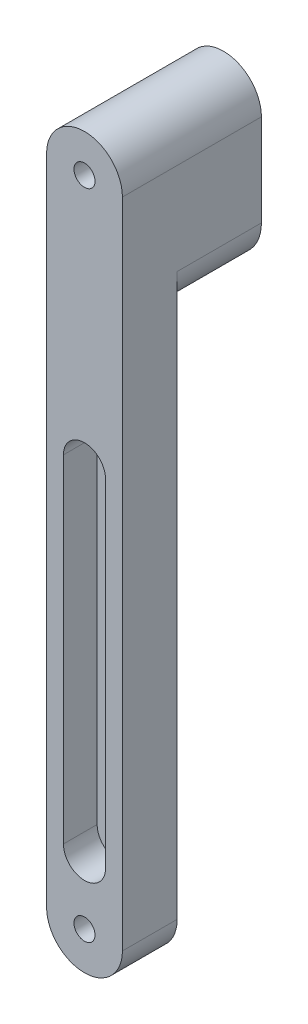
ISO-10303-21;
HEADER;
FILE_DESCRIPTION(('STEP AP214'),'2;1');
FILE_NAME('part.step','',(''),(''),'','','');
FILE_SCHEMA(('AUTOMOTIVE_DESIGN { 1 0 10303 214 1 1 1 1 }'));
ENDSEC;
DATA;
#1=APPLICATION_CONTEXT('core data for automotive mechanical design processes');
#2=APPLICATION_PROTOCOL_DEFINITION('international standard','automotive_design',2000,#1);
#3=PRODUCT_CONTEXT('',#1,'mechanical');
#4=PRODUCT('Part','Part','',(#3));
#5=PRODUCT_RELATED_PRODUCT_CATEGORY('part','',(#4));
#6=PRODUCT_DEFINITION_FORMATION('','',#4);
#7=PRODUCT_DEFINITION_CONTEXT('part definition',#1,'design');
#8=PRODUCT_DEFINITION('design','',#6,#7);
#9=PRODUCT_DEFINITION_SHAPE('','',#8);
#10=(LENGTH_UNIT() NAMED_UNIT(*) SI_UNIT(.MILLI.,.METRE.));
#11=(NAMED_UNIT(*) PLANE_ANGLE_UNIT() SI_UNIT($,.RADIAN.));
#12=(NAMED_UNIT(*) SI_UNIT($,.STERADIAN.) SOLID_ANGLE_UNIT());
#13=UNCERTAINTY_MEASURE_WITH_UNIT(LENGTH_MEASURE(1.E-05),#10,'distance_accuracy_value','');
#14=(GEOMETRIC_REPRESENTATION_CONTEXT(3) GLOBAL_UNCERTAINTY_ASSIGNED_CONTEXT((#13)) GLOBAL_UNIT_ASSIGNED_CONTEXT((#10,
#11,#12)) REPRESENTATION_CONTEXT('',''));
#15=CARTESIAN_POINT('',(0.,0.,0.));
#16=DIRECTION('',(0.,0.,1.));
#17=DIRECTION('',(1.,0.,0.));
#18=AXIS2_PLACEMENT_3D('',#15,#16,#17);
#19=CARTESIAN_POINT('',(0.,56.3943241889826,0.));
#20=DIRECTION('',(0.,0.,1.));
#21=DIRECTION('',(1.,0.,0.));
#22=AXIS2_PLACEMENT_3D('',#19,#20,#21);
#23=PLANE('',#22);
#24=CARTESIAN_POINT('',(0.,-98.6056758110174,0.));
#25=DIRECTION('',(0.,0.,1.));
#26=DIRECTION('',(1.,0.,0.));
#27=AXIS2_PLACEMENT_3D('',#24,#25,#26);
#28=CIRCLE('',#27,2.5);
#29=CARTESIAN_POINT('',(-2.49999999999998,-98.6056758110174,0.));
#30=VERTEX_POINT('',#29);
#31=EDGE_CURVE('E168',#30,#30,#28,.T.);
#32=ORIENTED_EDGE('',*,*,#31,.T.);
#33=EDGE_LOOP('',(#32));
#34=FACE_BOUND('',#33,.T.);
#35=DIRECTION('',(0.,-1.,0.));
#36=VECTOR('',#35,1.);
#37=CARTESIAN_POINT('',(-9.,56.3943241889826,0.));
#38=LINE('',#37,#36);
#39=CARTESIAN_POINT('',(-9.,34.3835962839502,0.));
#40=VERTEX_POINT('',#39);
#41=CARTESIAN_POINT('',(-8.99999999999998,-98.6056758110174,0.));
#42=VERTEX_POINT('',#41);
#43=EDGE_CURVE('E45',#40,#42,#38,.T.);
#44=ORIENTED_EDGE('',*,*,#43,.F.);
#45=CARTESIAN_POINT('',(1.,34.3835962839502,0.));
#46=DIRECTION('',(0.,0.,1.));
#47=DIRECTION('',(1.,0.,0.));
#48=AXIS2_PLACEMENT_3D('',#45,#46,#47);
#49=CIRCLE('',#48,10.);
#50=CARTESIAN_POINT('',(-0.999999999999996,24.5856373128174,0.));
#51=VERTEX_POINT('',#50);
#52=EDGE_CURVE('E11',#40,#51,#49,.T.);
#53=ORIENTED_EDGE('',*,*,#52,.T.);
#54=CARTESIAN_POINT('',(-0.999999999999996,34.5856373128174,0.));
#55=DIRECTION('',(0.,0.,1.));
#56=DIRECTION('',(1.,0.,0.));
#57=AXIS2_PLACEMENT_3D('',#54,#55,#56);
#58=CIRCLE('',#57,10.);
#59=CARTESIAN_POINT('',(9.,34.5856373128174,0.));
#60=VERTEX_POINT('',#59);
#61=EDGE_CURVE('E205',#51,#60,#58,.T.);
#62=ORIENTED_EDGE('',*,*,#61,.T.);
#63=DIRECTION('',(0.,1.,0.));
#64=VECTOR('',#63,1.);
#65=CARTESIAN_POINT('',(9.00000000000002,-98.6056758110174,0.));
#66=LINE('',#65,#64);
#67=CARTESIAN_POINT('',(9.00000000000002,-98.6056758110174,0.));
#68=VERTEX_POINT('',#67);
#69=EDGE_CURVE('E185',#68,#60,#66,.T.);
#70=ORIENTED_EDGE('',*,*,#69,.F.);
#71=CARTESIAN_POINT('',(0.,-98.6056758110174,0.));
#72=DIRECTION('',(0.,0.,1.));
#73=DIRECTION('',(1.,0.,0.));
#74=AXIS2_PLACEMENT_3D('',#71,#72,#73);
#75=CIRCLE('',#74,9.);
#76=EDGE_CURVE('E192',#42,#68,#75,.T.);
#77=ORIENTED_EDGE('',*,*,#76,.F.);
#78=EDGE_LOOP('',(#44,#53,#62,#70,#77));
#79=FACE_BOUND('',#78,.T.);
#80=ADVANCED_FACE('F31',(#34,#79),#23,.F.);
#81=CARTESIAN_POINT('',(0.,56.3943241889826,13.));
#82=DIRECTION('',(0.,0.,1.));
#83=DIRECTION('',(1.,0.,0.));
#84=AXIS2_PLACEMENT_3D('',#81,#82,#83);
#85=PLANE('',#84);
#86=CARTESIAN_POINT('',(0.,-83.6056758110174,13.));
#87=DIRECTION('',(0.,0.,1.));
#88=DIRECTION('',(1.,0.,0.));
#89=AXIS2_PLACEMENT_3D('',#86,#87,#88);
#90=CIRCLE('',#89,5.);
#91=CARTESIAN_POINT('',(-4.99999999999998,-83.6056758110175,13.));
#92=VERTEX_POINT('',#91);
#93=CARTESIAN_POINT('',(5.00000000000002,-83.6056758110174,13.));
#94=VERTEX_POINT('',#93);
#95=EDGE_CURVE('E142',#92,#94,#90,.T.);
#96=ORIENTED_EDGE('',*,*,#95,.F.);
#97=DIRECTION('',(0.,-1.,0.));
#98=VECTOR('',#97,1.);
#99=CARTESIAN_POINT('',(-4.99999999999999,-3.60567581101744,13.));
#100=LINE('',#99,#98);
#101=CARTESIAN_POINT('',(-4.99999999999999,-3.60567581101744,13.));
#102=VERTEX_POINT('',#101);
#103=EDGE_CURVE('E147',#102,#92,#100,.T.);
#104=ORIENTED_EDGE('',*,*,#103,.F.);
#105=CARTESIAN_POINT('',(0.,-3.60567581101744,13.));
#106=DIRECTION('',(0.,0.,1.));
#107=DIRECTION('',(1.,0.,0.));
#108=AXIS2_PLACEMENT_3D('',#105,#106,#107);
#109=CIRCLE('',#108,5.);
#110=CARTESIAN_POINT('',(5.00000000000001,-3.60567581101744,13.));
#111=VERTEX_POINT('',#110);
#112=EDGE_CURVE('E161',#111,#102,#109,.T.);
#113=ORIENTED_EDGE('',*,*,#112,.F.);
#114=DIRECTION('',(0.,1.,0.));
#115=VECTOR('',#114,1.);
#116=CARTESIAN_POINT('',(5.00000000000002,-83.6056758110174,13.));
#117=LINE('',#116,#115);
#118=EDGE_CURVE('E158',#94,#111,#117,.T.);
#119=ORIENTED_EDGE('',*,*,#118,.F.);
#120=EDGE_LOOP('',(#96,#104,#113,#119));
#121=FACE_BOUND('',#120,.T.);
#122=CARTESIAN_POINT('',(0.,56.3943241889826,13.));
#123=DIRECTION('',(0.,0.,1.));
#124=DIRECTION('',(1.,0.,0.));
#125=AXIS2_PLACEMENT_3D('',#122,#123,#124);
#126=CIRCLE('',#125,2.5);
#127=CARTESIAN_POINT('',(-2.5,56.3943241889826,13.));
#128=VERTEX_POINT('',#127);
#129=EDGE_CURVE('E178',#128,#128,#126,.T.);
#130=ORIENTED_EDGE('',*,*,#129,.F.);
#131=EDGE_LOOP('',(#130));
#132=FACE_BOUND('',#131,.T.);
#133=CARTESIAN_POINT('',(0.,56.3943241889826,13.));
#134=DIRECTION('',(0.,0.,1.));
#135=DIRECTION('',(1.,0.,0.));
#136=AXIS2_PLACEMENT_3D('',#133,#134,#135);
#137=CIRCLE('',#136,9.);
#138=CARTESIAN_POINT('',(9.,56.3943241889826,13.));
#139=VERTEX_POINT('',#138);
#140=CARTESIAN_POINT('',(-9.,56.3943241889826,13.));
#141=VERTEX_POINT('',#140);
#142=EDGE_CURVE('E120',#139,#141,#137,.T.);
#143=ORIENTED_EDGE('',*,*,#142,.T.);
#144=DIRECTION('',(0.,-1.,0.));
#145=VECTOR('',#144,1.);
#146=CARTESIAN_POINT('',(-9.,56.3943241889826,13.));
#147=LINE('',#146,#145);
#148=CARTESIAN_POINT('',(-8.99999999999998,-98.6056758110174,13.));
#149=VERTEX_POINT('',#148);
#150=EDGE_CURVE('E184',#141,#149,#147,.T.);
#151=ORIENTED_EDGE('',*,*,#150,.T.);
#152=CARTESIAN_POINT('',(0.,-98.6056758110174,13.));
#153=DIRECTION('',(0.,0.,1.));
#154=DIRECTION('',(1.,0.,0.));
#155=AXIS2_PLACEMENT_3D('',#152,#153,#154);
#156=CIRCLE('',#155,9.);
#157=CARTESIAN_POINT('',(9.00000000000002,-98.6056758110174,13.));
#158=VERTEX_POINT('',#157);
#159=EDGE_CURVE('E187',#149,#158,#156,.T.);
#160=ORIENTED_EDGE('',*,*,#159,.T.);
#161=DIRECTION('',(0.,1.,0.));
#162=VECTOR('',#161,1.);
#163=CARTESIAN_POINT('',(9.00000000000002,-98.6056758110174,13.));
#164=LINE('',#163,#162);
#165=EDGE_CURVE('E124',#158,#139,#164,.T.);
#166=ORIENTED_EDGE('',*,*,#165,.T.);
#167=EDGE_LOOP('',(#143,#151,#160,#166));
#168=FACE_BOUND('',#167,.T.);
#169=CARTESIAN_POINT('',(0.,-98.6056758110174,13.));
#170=DIRECTION('',(0.,0.,1.));
#171=DIRECTION('',(1.,0.,0.));
#172=AXIS2_PLACEMENT_3D('',#169,#170,#171);
#173=CIRCLE('',#172,2.5);
#174=CARTESIAN_POINT('',(-2.49999999999998,-98.6056758110174,13.));
#175=VERTEX_POINT('',#174);
#176=EDGE_CURVE('E175',#175,#175,#173,.T.);
#177=ORIENTED_EDGE('',*,*,#176,.F.);
#178=EDGE_LOOP('',(#177));
#179=FACE_BOUND('',#178,.T.);
#180=ADVANCED_FACE('F231',(#121,#132,#168,#179),#85,.T.);
#181=CARTESIAN_POINT('',(0.,56.3943241889826,13.));
#182=DIRECTION('',(0.,0.,-1.));
#183=DIRECTION('',(-1.,0.,0.));
#184=AXIS2_PLACEMENT_3D('',#181,#182,#183);
#185=CYLINDRICAL_SURFACE('',#184,9.);
#186=DIRECTION('',(0.,0.,-1.));
#187=VECTOR('',#186,1.);
#188=CARTESIAN_POINT('',(9.,56.3943241889826,13.));
#189=LINE('',#188,#187);
#190=CARTESIAN_POINT('',(9.,56.3943241889826,-20.));
#191=VERTEX_POINT('',#190);
#192=EDGE_CURVE('E113',#139,#191,#189,.T.);
#193=ORIENTED_EDGE('',*,*,#192,.T.);
#194=CARTESIAN_POINT('',(0.,56.3943241889826,-20.));
#195=DIRECTION('',(0.,0.,-1.));
#196=DIRECTION('',(-1.,0.,0.));
#197=AXIS2_PLACEMENT_3D('',#194,#195,#196);
#198=CIRCLE('',#197,9.);
#199=CARTESIAN_POINT('',(-9.,56.3943241889826,-20.));
#200=VERTEX_POINT('',#199);
#201=EDGE_CURVE('E118',#200,#191,#198,.T.);
#202=ORIENTED_EDGE('',*,*,#201,.F.);
#203=DIRECTION('',(0.,0.,-1.));
#204=VECTOR('',#203,1.);
#205=CARTESIAN_POINT('',(-9.,56.3943241889826,13.));
#206=LINE('',#205,#204);
#207=EDGE_CURVE('E201',#141,#200,#206,.T.);
#208=ORIENTED_EDGE('',*,*,#207,.F.);
#209=ORIENTED_EDGE('',*,*,#142,.F.);
#210=EDGE_LOOP('',(#193,#202,#208,#209));
#211=FACE_BOUND('',#210,.T.);
#212=ADVANCED_FACE('F115',(#211),#185,.T.);
#213=CARTESIAN_POINT('',(-9.,56.3943241889826,13.));
#214=DIRECTION('',(1.,0.,0.));
#215=DIRECTION('',(0.,1.,0.));
#216=AXIS2_PLACEMENT_3D('',#213,#214,#215);
#217=PLANE('',#216);
#218=DIRECTION('',(0.,1.,0.));
#219=VECTOR('',#218,1.);
#220=CARTESIAN_POINT('',(-9.,24.5856373128174,-20.));
#221=LINE('',#220,#219);
#222=CARTESIAN_POINT('',(-9.,34.3835962839502,-20.));
#223=VERTEX_POINT('',#222);
#224=EDGE_CURVE('E132',#223,#200,#221,.T.);
#225=ORIENTED_EDGE('',*,*,#224,.F.);
#226=DIRECTION('',(0.,0.,1.));
#227=VECTOR('',#226,1.);
#228=CARTESIAN_POINT('',(-9.,34.3835962839502,13.));
#229=LINE('',#228,#227);
#230=EDGE_CURVE('E208',#223,#40,#229,.T.);
#231=ORIENTED_EDGE('',*,*,#230,.T.);
#232=ORIENTED_EDGE('',*,*,#43,.T.);
#233=DIRECTION('',(0.,0.,-1.));
#234=VECTOR('',#233,1.);
#235=CARTESIAN_POINT('',(-8.99999999999998,-98.6056758110174,13.));
#236=LINE('',#235,#234);
#237=EDGE_CURVE('E394',#149,#42,#236,.T.);
#238=ORIENTED_EDGE('',*,*,#237,.F.);
#239=ORIENTED_EDGE('',*,*,#150,.F.);
#240=ORIENTED_EDGE('',*,*,#207,.T.);
#241=EDGE_LOOP('',(#225,#231,#232,#238,#239,#240));
#242=FACE_BOUND('',#241,.T.);
#243=ADVANCED_FACE('F212',(#242),#217,.F.);
#244=CARTESIAN_POINT('',(0.,-98.6056758110174,13.));
#245=DIRECTION('',(0.,0.,-1.));
#246=DIRECTION('',(-1.,0.,0.));
#247=AXIS2_PLACEMENT_3D('',#244,#245,#246);
#248=CYLINDRICAL_SURFACE('',#247,9.);
#249=ORIENTED_EDGE('',*,*,#76,.T.);
#250=DIRECTION('',(0.,0.,-1.));
#251=VECTOR('',#250,1.);
#252=CARTESIAN_POINT('',(9.00000000000002,-98.6056758110174,13.));
#253=LINE('',#252,#251);
#254=EDGE_CURVE('E123',#158,#68,#253,.T.);
#255=ORIENTED_EDGE('',*,*,#254,.F.);
#256=ORIENTED_EDGE('',*,*,#159,.F.);
#257=ORIENTED_EDGE('',*,*,#237,.T.);
#258=EDGE_LOOP('',(#249,#255,#256,#257));
#259=FACE_BOUND('',#258,.T.);
#260=ADVANCED_FACE('F244',(#259),#248,.T.);
#261=CARTESIAN_POINT('',(9.00000000000002,-98.6056758110174,13.));
#262=DIRECTION('',(-1.,0.,0.));
#263=DIRECTION('',(0.,-1.,0.));
#264=AXIS2_PLACEMENT_3D('',#261,#262,#263);
#265=PLANE('',#264);
#266=ORIENTED_EDGE('',*,*,#69,.T.);
#267=DIRECTION('',(0.,0.,1.));
#268=VECTOR('',#267,1.);
#269=CARTESIAN_POINT('',(9.,34.5856373128175,13.));
#270=LINE('',#269,#268);
#271=CARTESIAN_POINT('',(9.,34.5856373128174,-20.));
#272=VERTEX_POINT('',#271);
#273=EDGE_CURVE('E130',#60,#272,#270,.F.);
#274=ORIENTED_EDGE('',*,*,#273,.T.);
#275=DIRECTION('',(0.,-1.,0.));
#276=VECTOR('',#275,1.);
#277=CARTESIAN_POINT('',(9.,56.3943241889826,-20.));
#278=LINE('',#277,#276);
#279=EDGE_CURVE('E127',#191,#272,#278,.T.);
#280=ORIENTED_EDGE('',*,*,#279,.F.);
#281=ORIENTED_EDGE('',*,*,#192,.F.);
#282=ORIENTED_EDGE('',*,*,#165,.F.);
#283=ORIENTED_EDGE('',*,*,#254,.T.);
#284=EDGE_LOOP('',(#266,#274,#280,#281,#282,#283));
#285=FACE_BOUND('',#284,.T.);
#286=ADVANCED_FACE('F128',(#285),#265,.F.);
#287=CARTESIAN_POINT('',(0.,56.3943241889826,13.));
#288=DIRECTION('',(0.,0.,-1.));
#289=DIRECTION('',(-1.,0.,0.));
#290=AXIS2_PLACEMENT_3D('',#287,#288,#289);
#291=CYLINDRICAL_SURFACE('',#290,2.5);
#292=CARTESIAN_POINT('',(0.,56.3943241889826,-20.));
#293=DIRECTION('',(0.,0.,1.));
#294=DIRECTION('',(1.,0.,0.));
#295=AXIS2_PLACEMENT_3D('',#292,#293,#294);
#296=CIRCLE('',#295,2.5);
#297=CARTESIAN_POINT('',(-2.5,56.3943241889826,-20.));
#298=VERTEX_POINT('',#297);
#299=EDGE_CURVE('E136',#298,#298,#296,.T.);
#300=CARTESIAN_POINT('',(-2.5,56.3943241889826,13.));
#301=CARTESIAN_POINT('',(-2.5,56.3943241889826,12.65625));
#302=CARTESIAN_POINT('',(-2.5,56.3943241889826,12.3125));
#303=CARTESIAN_POINT('',(-2.5,56.3943241889826,11.625));
#304=CARTESIAN_POINT('',(-2.5,56.3943241889826,11.28125));
#305=CARTESIAN_POINT('',(-2.5,56.3943241889826,10.59375));
#306=CARTESIAN_POINT('',(-2.5,56.3943241889826,10.25));
#307=CARTESIAN_POINT('',(-2.5,56.3943241889826,9.5625));
#308=CARTESIAN_POINT('',(-2.5,56.3943241889826,9.21875));
#309=CARTESIAN_POINT('',(-2.5,56.3943241889826,8.53125));
#310=CARTESIAN_POINT('',(-2.5,56.3943241889826,8.1875));
#311=CARTESIAN_POINT('',(-2.5,56.3943241889826,7.5));
#312=CARTESIAN_POINT('',(-2.5,56.3943241889826,7.15625));
#313=CARTESIAN_POINT('',(-2.5,56.3943241889826,6.46875));
#314=CARTESIAN_POINT('',(-2.5,56.3943241889826,6.125));
#315=CARTESIAN_POINT('',(-2.5,56.3943241889826,5.4375));
#316=CARTESIAN_POINT('',(-2.5,56.3943241889826,5.09375));
#317=CARTESIAN_POINT('',(-2.5,56.3943241889826,4.40625));
#318=CARTESIAN_POINT('',(-2.5,56.3943241889826,4.06249999999999));
#319=CARTESIAN_POINT('',(-2.5,56.3943241889826,3.37499999999999));
#320=CARTESIAN_POINT('',(-2.5,56.3943241889826,3.03124999999999));
#321=CARTESIAN_POINT('',(-2.5,56.3943241889826,2.34374999999999));
#322=CARTESIAN_POINT('',(-2.5,56.3943241889826,1.99999999999999));
#323=CARTESIAN_POINT('',(-2.5,56.3943241889826,1.31249999999999));
#324=CARTESIAN_POINT('',(-2.5,56.3943241889826,0.968749999999994));
#325=CARTESIAN_POINT('',(-2.5,56.3943241889826,0.281249999999993));
#326=CARTESIAN_POINT('',(-2.5,56.3943241889826,-0.062500000000007));
#327=CARTESIAN_POINT('',(-2.5,56.3943241889826,-0.750000000000007));
#328=CARTESIAN_POINT('',(-2.5,56.3943241889826,-1.09375000000001));
#329=CARTESIAN_POINT('',(-2.5,56.3943241889826,-1.78125000000001));
#330=CARTESIAN_POINT('',(-2.5,56.3943241889826,-2.12500000000001));
#331=CARTESIAN_POINT('',(-2.5,56.3943241889826,-2.81250000000001));
#332=CARTESIAN_POINT('',(-2.5,56.3943241889826,-3.15625000000001));
#333=CARTESIAN_POINT('',(-2.5,56.3943241889826,-3.84375000000001));
#334=CARTESIAN_POINT('',(-2.5,56.3943241889826,-4.18750000000001));
#335=CARTESIAN_POINT('',(-2.5,56.3943241889826,-4.87500000000001));
#336=CARTESIAN_POINT('',(-2.5,56.3943241889826,-5.21875000000001));
#337=CARTESIAN_POINT('',(-2.5,56.3943241889826,-5.90625000000001));
#338=CARTESIAN_POINT('',(-2.5,56.3943241889826,-6.25000000000001));
#339=CARTESIAN_POINT('',(-2.5,56.3943241889826,-6.93750000000001));
#340=CARTESIAN_POINT('',(-2.5,56.3943241889826,-7.28125000000001));
#341=CARTESIAN_POINT('',(-2.5,56.3943241889826,-7.96875000000001));
#342=CARTESIAN_POINT('',(-2.5,56.3943241889826,-8.31250000000001));
#343=CARTESIAN_POINT('',(-2.5,56.3943241889826,-9.00000000000001));
#344=CARTESIAN_POINT('',(-2.5,56.3943241889826,-9.34375000000001));
#345=CARTESIAN_POINT('',(-2.5,56.3943241889826,-10.03125));
#346=CARTESIAN_POINT('',(-2.5,56.3943241889826,-10.375));
#347=CARTESIAN_POINT('',(-2.5,56.3943241889826,-11.0625));
#348=CARTESIAN_POINT('',(-2.5,56.3943241889826,-11.40625));
#349=CARTESIAN_POINT('',(-2.5,56.3943241889826,-12.09375));
#350=CARTESIAN_POINT('',(-2.5,56.3943241889826,-12.4375));
#351=CARTESIAN_POINT('',(-2.5,56.3943241889826,-13.125));
#352=CARTESIAN_POINT('',(-2.5,56.3943241889826,-13.46875));
#353=CARTESIAN_POINT('',(-2.5,56.3943241889826,-14.15625));
#354=CARTESIAN_POINT('',(-2.5,56.3943241889826,-14.5));
#355=CARTESIAN_POINT('',(-2.5,56.3943241889826,-15.1875));
#356=CARTESIAN_POINT('',(-2.5,56.3943241889826,-15.53125));
#357=CARTESIAN_POINT('',(-2.5,56.3943241889826,-16.21875));
#358=CARTESIAN_POINT('',(-2.5,56.3943241889826,-16.5625));
#359=CARTESIAN_POINT('',(-2.5,56.3943241889826,-17.25));
#360=CARTESIAN_POINT('',(-2.5,56.3943241889826,-17.59375));
#361=CARTESIAN_POINT('',(-2.5,56.3943241889826,-18.28125));
#362=CARTESIAN_POINT('',(-2.5,56.3943241889826,-18.625));
#363=CARTESIAN_POINT('',(-2.5,56.3943241889826,-19.3125));
#364=CARTESIAN_POINT('',(-2.5,56.3943241889826,-19.65625));
#365=CARTESIAN_POINT('',(-2.5,56.3943241889826,-20.));
#366=B_SPLINE_CURVE_WITH_KNOTS('',3,(#300,#301,#302,#303,#304,#305,#306,#307,#308,#309,#310,
#311,#312,#313,#314,#315,#316,#317,#318,#319,#320,#321,#322,#323,#324,#325,#326,#327,#328,#329,
#330,#331,#332,#333,#334,#335,#336,#337,#338,#339,#340,#341,#342,#343,#344,#345,#346,#347,#348,
#349,#350,#351,#352,#353,#354,#355,#356,#357,#358,#359,#360,#361,#362,#363,#364,#365),
.UNSPECIFIED.,.F.,.F.,(4,2,2,2,2,2,2,2,2,2,2,2,2,2,2,2,2,2,2,2,2,2,2,2,2,2,2,2,2,2,2,2,4),(0.,
1.03125,2.0625,3.09375,4.125,5.15625,6.1875,7.21875,8.25,9.28125,10.3125,11.34375,12.375,
13.40625,14.4375,15.46875,16.5,17.53125,18.5625,19.59375,20.625,21.65625,22.6875,23.71875,24.75,
25.78125,26.8125,27.84375,28.875,29.90625,30.9375,31.96875,33.),.UNSPECIFIED.);
#367=EDGE_CURVE('BSEAM243',#128,#298,#366,.T.);
#368=ORIENTED_EDGE('',*,*,#129,.T.);
#369=ORIENTED_EDGE('',*,*,#299,.F.);
#370=ORIENTED_EDGE('',*,*,#367,.T.);
#371=ORIENTED_EDGE('',*,*,#367,.F.);
#372=EDGE_LOOP('',(#368,#370,#369,#371));
#373=FACE_BOUND('',#372,.T.);
#374=ADVANCED_FACE('F243',(#373),#291,.F.);
#375=CARTESIAN_POINT('',(0.,-98.6056758110174,13.));
#376=DIRECTION('',(0.,0.,-1.));
#377=DIRECTION('',(-1.,0.,0.));
#378=AXIS2_PLACEMENT_3D('',#375,#376,#377);
#379=CYLINDRICAL_SURFACE('',#378,2.5);
#380=CARTESIAN_POINT('',(-2.49999999999998,-98.6056758110174,13.));
#381=CARTESIAN_POINT('',(-2.49999999999998,-98.6056758110174,12.8645833333333));
#382=CARTESIAN_POINT('',(-2.49999999999998,-98.6056758110174,12.7291666666667));
#383=CARTESIAN_POINT('',(-2.49999999999998,-98.6056758110174,12.4583333333333));
#384=CARTESIAN_POINT('',(-2.49999999999998,-98.6056758110174,12.3229166666667));
#385=CARTESIAN_POINT('',(-2.49999999999998,-98.6056758110174,12.0520833333333));
#386=CARTESIAN_POINT('',(-2.49999999999998,-98.6056758110174,11.9166666666667));
#387=CARTESIAN_POINT('',(-2.49999999999998,-98.6056758110174,11.6458333333333));
#388=CARTESIAN_POINT('',(-2.49999999999998,-98.6056758110174,11.5104166666667));
#389=CARTESIAN_POINT('',(-2.49999999999998,-98.6056758110174,11.2395833333333));
#390=CARTESIAN_POINT('',(-2.49999999999998,-98.6056758110174,11.1041666666667));
#391=CARTESIAN_POINT('',(-2.49999999999998,-98.6056758110174,10.8333333333333));
#392=CARTESIAN_POINT('',(-2.49999999999998,-98.6056758110174,10.6979166666667));
#393=CARTESIAN_POINT('',(-2.49999999999998,-98.6056758110174,10.4270833333333));
#394=CARTESIAN_POINT('',(-2.49999999999998,-98.6056758110174,10.2916666666667));
#395=CARTESIAN_POINT('',(-2.49999999999998,-98.6056758110174,10.0208333333333));
#396=CARTESIAN_POINT('',(-2.49999999999998,-98.6056758110174,9.88541666666667));
#397=CARTESIAN_POINT('',(-2.49999999999998,-98.6056758110174,9.61458333333333));
#398=CARTESIAN_POINT('',(-2.49999999999998,-98.6056758110174,9.47916666666667));
#399=CARTESIAN_POINT('',(-2.49999999999998,-98.6056758110174,9.20833333333333));
#400=CARTESIAN_POINT('',(-2.49999999999998,-98.6056758110174,9.07291666666667));
#401=CARTESIAN_POINT('',(-2.49999999999998,-98.6056758110174,8.80208333333333));
#402=CARTESIAN_POINT('',(-2.49999999999998,-98.6056758110174,8.66666666666667));
#403=CARTESIAN_POINT('',(-2.49999999999998,-98.6056758110174,8.39583333333333));
#404=CARTESIAN_POINT('',(-2.49999999999998,-98.6056758110174,8.26041666666667));
#405=CARTESIAN_POINT('',(-2.49999999999998,-98.6056758110174,7.98958333333333));
#406=CARTESIAN_POINT('',(-2.49999999999998,-98.6056758110174,7.85416666666667));
#407=CARTESIAN_POINT('',(-2.49999999999998,-98.6056758110174,7.58333333333333));
#408=CARTESIAN_POINT('',(-2.49999999999998,-98.6056758110174,7.44791666666667));
#409=CARTESIAN_POINT('',(-2.49999999999998,-98.6056758110174,7.17708333333333));
#410=CARTESIAN_POINT('',(-2.49999999999998,-98.6056758110174,7.04166666666667));
#411=CARTESIAN_POINT('',(-2.49999999999998,-98.6056758110174,6.77083333333333));
#412=CARTESIAN_POINT('',(-2.49999999999998,-98.6056758110174,6.63541666666667));
#413=CARTESIAN_POINT('',(-2.49999999999998,-98.6056758110174,6.36458333333333));
#414=CARTESIAN_POINT('',(-2.49999999999998,-98.6056758110174,6.22916666666667));
#415=CARTESIAN_POINT('',(-2.49999999999998,-98.6056758110174,5.95833333333333));
#416=CARTESIAN_POINT('',(-2.49999999999998,-98.6056758110174,5.82291666666667));
#417=CARTESIAN_POINT('',(-2.49999999999998,-98.6056758110174,5.55208333333333));
#418=CARTESIAN_POINT('',(-2.49999999999998,-98.6056758110174,5.41666666666667));
#419=CARTESIAN_POINT('',(-2.49999999999998,-98.6056758110174,5.14583333333333));
#420=CARTESIAN_POINT('',(-2.49999999999998,-98.6056758110174,5.01041666666667));
#421=CARTESIAN_POINT('',(-2.49999999999998,-98.6056758110174,4.73958333333333));
#422=CARTESIAN_POINT('',(-2.49999999999998,-98.6056758110174,4.60416666666667));
#423=CARTESIAN_POINT('',(-2.49999999999998,-98.6056758110174,4.33333333333333));
#424=CARTESIAN_POINT('',(-2.49999999999998,-98.6056758110174,4.19791666666667));
#425=CARTESIAN_POINT('',(-2.49999999999998,-98.6056758110174,3.92708333333333));
#426=CARTESIAN_POINT('',(-2.49999999999998,-98.6056758110174,3.79166666666667));
#427=CARTESIAN_POINT('',(-2.49999999999998,-98.6056758110174,3.52083333333333));
#428=CARTESIAN_POINT('',(-2.49999999999998,-98.6056758110174,3.38541666666667));
#429=CARTESIAN_POINT('',(-2.49999999999998,-98.6056758110174,3.11458333333333));
#430=CARTESIAN_POINT('',(-2.49999999999998,-98.6056758110174,2.97916666666667));
#431=CARTESIAN_POINT('',(-2.49999999999998,-98.6056758110174,2.70833333333333));
#432=CARTESIAN_POINT('',(-2.49999999999998,-98.6056758110174,2.57291666666667));
#433=CARTESIAN_POINT('',(-2.49999999999998,-98.6056758110174,2.30208333333333));
#434=CARTESIAN_POINT('',(-2.49999999999998,-98.6056758110174,2.16666666666667));
#435=CARTESIAN_POINT('',(-2.49999999999998,-98.6056758110174,1.89583333333333));
#436=CARTESIAN_POINT('',(-2.49999999999998,-98.6056758110174,1.76041666666667));
#437=CARTESIAN_POINT('',(-2.49999999999998,-98.6056758110174,1.48958333333333));
#438=CARTESIAN_POINT('',(-2.49999999999998,-98.6056758110174,1.35416666666667));
#439=CARTESIAN_POINT('',(-2.49999999999998,-98.6056758110174,1.08333333333333));
#440=CARTESIAN_POINT('',(-2.49999999999998,-98.6056758110174,0.947916666666667));
#441=CARTESIAN_POINT('',(-2.49999999999998,-98.6056758110174,0.677083333333334));
#442=CARTESIAN_POINT('',(-2.49999999999998,-98.6056758110174,0.541666666666667));
#443=CARTESIAN_POINT('',(-2.49999999999998,-98.6056758110174,0.270833333333334));
#444=CARTESIAN_POINT('',(-2.49999999999998,-98.6056758110174,0.135416666666667));
#445=CARTESIAN_POINT('',(-2.49999999999998,-98.6056758110174,0.));
#446=B_SPLINE_CURVE_WITH_KNOTS('',3,(#380,#381,#382,#383,#384,#385,#386,#387,#388,#389,#390,
#391,#392,#393,#394,#395,#396,#397,#398,#399,#400,#401,#402,#403,#404,#405,#406,#407,#408,#409,
#410,#411,#412,#413,#414,#415,#416,#417,#418,#419,#420,#421,#422,#423,#424,#425,#426,#427,#428,
#429,#430,#431,#432,#433,#434,#435,#436,#437,#438,#439,#440,#441,#442,#443,#444,#445),
.UNSPECIFIED.,.F.,.F.,(4,2,2,2,2,2,2,2,2,2,2,2,2,2,2,2,2,2,2,2,2,2,2,2,2,2,2,2,2,2,2,2,4),(0.,
0.406249999999999,0.812499999999999,1.21875,1.625,2.03125,2.4375,2.84375,3.25,3.65625,4.0625,
4.46875,4.875,5.28125,5.6875,6.09375,6.5,6.90625,7.3125,7.71875,8.125,8.53125,8.9375,9.34375,
9.75,10.15625,10.5625,10.96875,11.375,11.78125,12.1875,12.59375,13.),.UNSPECIFIED.);
#447=EDGE_CURVE('BSEAM274',#175,#30,#446,.T.);
#448=ORIENTED_EDGE('',*,*,#176,.T.);
#449=ORIENTED_EDGE('',*,*,#31,.F.);
#450=ORIENTED_EDGE('',*,*,#447,.T.);
#451=ORIENTED_EDGE('',*,*,#447,.F.);
#452=EDGE_LOOP('',(#448,#450,#449,#451));
#453=FACE_BOUND('',#452,.T.);
#454=ADVANCED_FACE('F274',(#453),#379,.F.);
#455=CARTESIAN_POINT('',(0.,-83.6056758110174,5.));
#456=DIRECTION('',(0.,0.,1.));
#457=DIRECTION('',(1.,0.,0.));
#458=AXIS2_PLACEMENT_3D('',#455,#456,#457);
#459=CYLINDRICAL_SURFACE('',#458,5.);
#460=ORIENTED_EDGE('',*,*,#95,.T.);
#461=DIRECTION('',(0.,0.,1.));
#462=VECTOR('',#461,1.);
#463=CARTESIAN_POINT('',(5.00000000000002,-83.6056758110174,5.));
#464=LINE('',#463,#462);
#465=CARTESIAN_POINT('',(5.00000000000002,-83.6056758110174,5.));
#466=VERTEX_POINT('',#465);
#467=EDGE_CURVE('E156',#466,#94,#464,.T.);
#468=ORIENTED_EDGE('',*,*,#467,.F.);
#469=CARTESIAN_POINT('',(0.,-83.6056758110174,5.));
#470=DIRECTION('',(0.,0.,1.));
#471=DIRECTION('',(1.,0.,0.));
#472=AXIS2_PLACEMENT_3D('',#469,#470,#471);
#473=CIRCLE('',#472,5.);
#474=CARTESIAN_POINT('',(-4.99999999999998,-83.6056758110175,5.));
#475=VERTEX_POINT('',#474);
#476=EDGE_CURVE('E143',#475,#466,#473,.T.);
#477=ORIENTED_EDGE('',*,*,#476,.F.);
#478=DIRECTION('',(0.,0.,1.));
#479=VECTOR('',#478,1.);
#480=CARTESIAN_POINT('',(-4.99999999999998,-83.6056758110175,5.));
#481=LINE('',#480,#479);
#482=EDGE_CURVE('E166',#475,#92,#481,.T.);
#483=ORIENTED_EDGE('',*,*,#482,.T.);
#484=EDGE_LOOP('',(#460,#468,#477,#483));
#485=FACE_BOUND('',#484,.T.);
#486=ADVANCED_FACE('F282',(#485),#459,.F.);
#487=CARTESIAN_POINT('',(-4.99999999999999,-3.60567581101744,5.));
#488=DIRECTION('',(-1.,0.,0.));
#489=DIRECTION('',(0.,-1.,0.));
#490=AXIS2_PLACEMENT_3D('',#487,#488,#489);
#491=PLANE('',#490);
#492=ORIENTED_EDGE('',*,*,#103,.T.);
#493=ORIENTED_EDGE('',*,*,#482,.F.);
#494=DIRECTION('',(0.,-1.,0.));
#495=VECTOR('',#494,1.);
#496=CARTESIAN_POINT('',(-4.99999999999999,-3.60567581101744,5.));
#497=LINE('',#496,#495);
#498=CARTESIAN_POINT('',(-4.99999999999999,-3.60567581101744,5.));
#499=VERTEX_POINT('',#498);
#500=EDGE_CURVE('E153',#499,#475,#497,.T.);
#501=ORIENTED_EDGE('',*,*,#500,.F.);
#502=DIRECTION('',(0.,0.,1.));
#503=VECTOR('',#502,1.);
#504=CARTESIAN_POINT('',(-4.99999999999999,-3.60567581101744,5.));
#505=LINE('',#504,#503);
#506=EDGE_CURVE('E169',#499,#102,#505,.T.);
#507=ORIENTED_EDGE('',*,*,#506,.T.);
#508=EDGE_LOOP('',(#492,#493,#501,#507));
#509=FACE_BOUND('',#508,.T.);
#510=ADVANCED_FACE('F290',(#509),#491,.F.);
#511=CARTESIAN_POINT('',(0.,-3.60567581101744,5.));
#512=DIRECTION('',(0.,0.,1.));
#513=DIRECTION('',(1.,0.,0.));
#514=AXIS2_PLACEMENT_3D('',#511,#512,#513);
#515=CYLINDRICAL_SURFACE('',#514,5.);
#516=ORIENTED_EDGE('',*,*,#112,.T.);
#517=ORIENTED_EDGE('',*,*,#506,.F.);
#518=CARTESIAN_POINT('',(0.,-3.60567581101744,5.));
#519=DIRECTION('',(0.,0.,1.));
#520=DIRECTION('',(1.,0.,0.));
#521=AXIS2_PLACEMENT_3D('',#518,#519,#520);
#522=CIRCLE('',#521,5.);
#523=CARTESIAN_POINT('',(5.00000000000001,-3.60567581101744,5.));
#524=VERTEX_POINT('',#523);
#525=EDGE_CURVE('E150',#524,#499,#522,.T.);
#526=ORIENTED_EDGE('',*,*,#525,.F.);
#527=DIRECTION('',(0.,0.,1.));
#528=VECTOR('',#527,1.);
#529=CARTESIAN_POINT('',(5.00000000000001,-3.60567581101744,5.));
#530=LINE('',#529,#528);
#531=EDGE_CURVE('E171',#524,#111,#530,.T.);
#532=ORIENTED_EDGE('',*,*,#531,.T.);
#533=EDGE_LOOP('',(#516,#517,#526,#532));
#534=FACE_BOUND('',#533,.T.);
#535=ADVANCED_FACE('F298',(#534),#515,.F.);
#536=CARTESIAN_POINT('',(5.00000000000002,-83.6056758110174,5.));
#537=DIRECTION('',(1.,0.,0.));
#538=DIRECTION('',(0.,1.,0.));
#539=AXIS2_PLACEMENT_3D('',#536,#537,#538);
#540=PLANE('',#539);
#541=ORIENTED_EDGE('',*,*,#118,.T.);
#542=ORIENTED_EDGE('',*,*,#531,.F.);
#543=DIRECTION('',(0.,1.,0.));
#544=VECTOR('',#543,1.);
#545=CARTESIAN_POINT('',(5.00000000000002,-83.6056758110174,5.));
#546=LINE('',#545,#544);
#547=EDGE_CURVE('E146',#466,#524,#546,.T.);
#548=ORIENTED_EDGE('',*,*,#547,.F.);
#549=ORIENTED_EDGE('',*,*,#467,.T.);
#550=EDGE_LOOP('',(#541,#542,#548,#549));
#551=FACE_BOUND('',#550,.T.);
#552=ADVANCED_FACE('F306',(#551),#540,.F.);
#553=CARTESIAN_POINT('',(0.,-83.6056758110174,5.));
#554=DIRECTION('',(0.,0.,1.));
#555=DIRECTION('',(1.,0.,0.));
#556=AXIS2_PLACEMENT_3D('',#553,#554,#555);
#557=PLANE('',#556);
#558=ORIENTED_EDGE('',*,*,#476,.T.);
#559=ORIENTED_EDGE('',*,*,#547,.T.);
#560=ORIENTED_EDGE('',*,*,#525,.T.);
#561=ORIENTED_EDGE('',*,*,#500,.T.);
#562=EDGE_LOOP('',(#558,#559,#560,#561));
#563=FACE_BOUND('',#562,.T.);
#564=ADVANCED_FACE('F226',(#563),#557,.T.);
#565=CARTESIAN_POINT('',(0.,56.3943241889826,-20.));
#566=DIRECTION('',(0.,0.,-1.));
#567=DIRECTION('',(-1.,0.,0.));
#568=AXIS2_PLACEMENT_3D('',#565,#566,#567);
#569=PLANE('',#568);
#570=ORIENTED_EDGE('',*,*,#299,.T.);
#571=EDGE_LOOP('',(#570));
#572=FACE_BOUND('',#571,.T.);
#573=CARTESIAN_POINT('',(-0.999999999999996,34.5856373128174,-20.));
#574=DIRECTION('',(0.,0.,-1.));
#575=DIRECTION('',(-1.,0.,0.));
#576=AXIS2_PLACEMENT_3D('',#573,#574,#575);
#577=CIRCLE('',#576,10.);
#578=CARTESIAN_POINT('',(-0.999999999999996,24.5856373128174,-20.));
#579=VERTEX_POINT('',#578);
#580=EDGE_CURVE('E203',#272,#579,#577,.T.);
#581=ORIENTED_EDGE('',*,*,#580,.T.);
#582=CARTESIAN_POINT('',(1.,34.3835962839502,-20.));
#583=DIRECTION('',(0.,0.,-1.));
#584=DIRECTION('',(-1.,0.,0.));
#585=AXIS2_PLACEMENT_3D('',#582,#583,#584);
#586=CIRCLE('',#585,10.);
#587=EDGE_CURVE('E39',#579,#223,#586,.T.);
#588=ORIENTED_EDGE('',*,*,#587,.T.);
#589=ORIENTED_EDGE('',*,*,#224,.T.);
#590=ORIENTED_EDGE('',*,*,#201,.T.);
#591=ORIENTED_EDGE('',*,*,#279,.T.);
#592=EDGE_LOOP('',(#581,#588,#589,#590,#591));
#593=FACE_BOUND('',#592,.T.);
#594=ADVANCED_FACE('F134',(#572,#593),#569,.T.);
#595=CARTESIAN_POINT('',(-0.999999999999996,34.5856373128174,-20.));
#596=DIRECTION('',(0.,0.,1.));
#597=DIRECTION('',(1.,0.,0.));
#598=AXIS2_PLACEMENT_3D('',#595,#596,#597);
#599=CYLINDRICAL_SURFACE('',#598,10.);
#600=ORIENTED_EDGE('',*,*,#580,.F.);
#601=ORIENTED_EDGE('',*,*,#273,.F.);
#602=ORIENTED_EDGE('',*,*,#61,.F.);
#603=DIRECTION('',(0.,0.,1.));
#604=VECTOR('',#603,1.);
#605=CARTESIAN_POINT('',(-0.999999999999996,24.5856373128174,-20.));
#606=LINE('',#605,#604);
#607=EDGE_CURVE('E198',#579,#51,#606,.T.);
#608=ORIENTED_EDGE('',*,*,#607,.F.);
#609=EDGE_LOOP('',(#600,#601,#602,#608));
#610=FACE_BOUND('',#609,.T.);
#611=ADVANCED_FACE('F220',(#610),#599,.T.);
#612=CARTESIAN_POINT('',(1.,34.3835962839502,-20.));
#613=DIRECTION('',(0.,0.,1.));
#614=DIRECTION('',(1.,0.,0.));
#615=AXIS2_PLACEMENT_3D('',#612,#613,#614);
#616=CYLINDRICAL_SURFACE('',#615,10.);
#617=ORIENTED_EDGE('',*,*,#587,.F.);
#618=ORIENTED_EDGE('',*,*,#607,.T.);
#619=ORIENTED_EDGE('',*,*,#52,.F.);
#620=ORIENTED_EDGE('',*,*,#230,.F.);
#621=EDGE_LOOP('',(#617,#618,#619,#620));
#622=FACE_BOUND('',#621,.T.);
#623=ADVANCED_FACE('F33',(#622),#616,.T.);
#624=CLOSED_SHELL('',(#80,#180,#212,#243,#260,#286,#374,#454,#486,#510,#535,#552,#564,#594,#611,#623));
#625=MANIFOLD_SOLID_BREP('B2',#624);
#626=ADVANCED_BREP_SHAPE_REPRESENTATION('',(#18,#625),#14);
#627=SHAPE_DEFINITION_REPRESENTATION(#9,#626);
ENDSEC;
END-ISO-10303-21;
